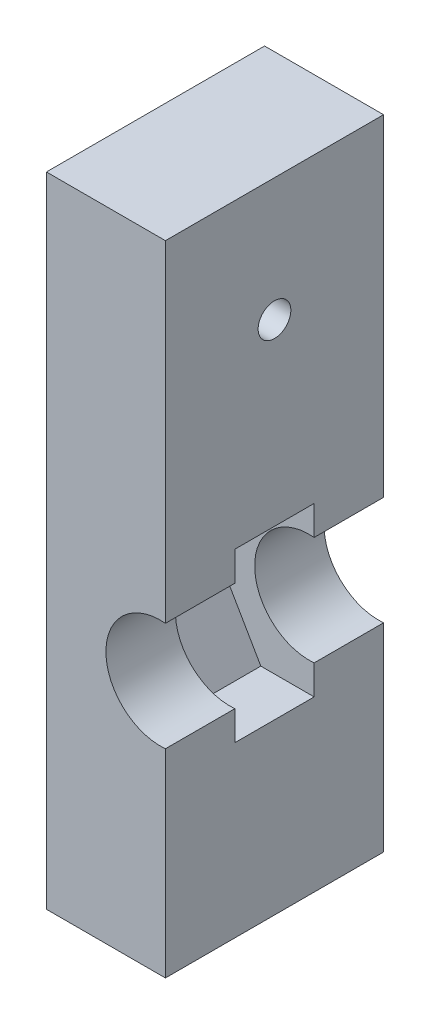
ISO-10303-21;
HEADER;
FILE_DESCRIPTION(('STEP AP214'),'2;1');
FILE_NAME('part.step','',(''),(''),'','','');
FILE_SCHEMA(('AUTOMOTIVE_DESIGN { 1 0 10303 214 1 1 1 1 }'));
ENDSEC;
DATA;
#1=APPLICATION_CONTEXT('core data for automotive mechanical design processes');
#2=APPLICATION_PROTOCOL_DEFINITION('international standard','automotive_design',2000,#1);
#3=PRODUCT_CONTEXT('',#1,'mechanical');
#4=PRODUCT('Part','Part','',(#3));
#5=PRODUCT_RELATED_PRODUCT_CATEGORY('part','',(#4));
#6=PRODUCT_DEFINITION_FORMATION('','',#4);
#7=PRODUCT_DEFINITION_CONTEXT('part definition',#1,'design');
#8=PRODUCT_DEFINITION('design','',#6,#7);
#9=PRODUCT_DEFINITION_SHAPE('','',#8);
#10=(LENGTH_UNIT() NAMED_UNIT(*) SI_UNIT(.MILLI.,.METRE.));
#11=(NAMED_UNIT(*) PLANE_ANGLE_UNIT() SI_UNIT($,.RADIAN.));
#12=(NAMED_UNIT(*) SI_UNIT($,.STERADIAN.) SOLID_ANGLE_UNIT());
#13=UNCERTAINTY_MEASURE_WITH_UNIT(LENGTH_MEASURE(1.E-05),#10,'distance_accuracy_value','');
#14=(GEOMETRIC_REPRESENTATION_CONTEXT(3) GLOBAL_UNCERTAINTY_ASSIGNED_CONTEXT((#13)) GLOBAL_UNIT_ASSIGNED_CONTEXT((#10,
#11,#12)) REPRESENTATION_CONTEXT('',''));
#15=CARTESIAN_POINT('',(0.,0.,0.));
#16=DIRECTION('',(0.,0.,1.));
#17=DIRECTION('',(1.,0.,0.));
#18=AXIS2_PLACEMENT_3D('',#15,#16,#17);
#19=CARTESIAN_POINT('',(-11.8674698795181,-59.7793146590531,8.));
#20=DIRECTION('',(0.,1.,0.));
#21=DIRECTION('',(0.,0.,1.));
#22=AXIS2_PLACEMENT_3D('',#19,#20,#21);
#23=PLANE('',#22);
#24=DIRECTION('',(0.,0.,-1.));
#25=VECTOR('',#24,1.);
#26=CARTESIAN_POINT('',(0.132530120481924,-59.7793146590531,15.));
#27=LINE('',#26,#25);
#28=CARTESIAN_POINT('',(0.132530120481924,-59.7793146590531,15.));
#29=VERTEX_POINT('',#28);
#30=CARTESIAN_POINT('',(0.132530120481924,-59.7793146590531,-7.));
#31=VERTEX_POINT('',#30);
#32=EDGE_CURVE('E133',#29,#31,#27,.T.);
#33=ORIENTED_EDGE('',*,*,#32,.F.);
#34=DIRECTION('',(1.,0.,0.));
#35=VECTOR('',#34,1.);
#36=CARTESIAN_POINT('',(-11.8674698795181,-59.7793146590531,15.));
#37=LINE('',#36,#35);
#38=CARTESIAN_POINT('',(-11.8674698795181,-59.7793146590531,15.));
#39=VERTEX_POINT('',#38);
#40=EDGE_CURVE('E145',#39,#29,#37,.T.);
#41=ORIENTED_EDGE('',*,*,#40,.F.);
#42=DIRECTION('',(0.,0.,-1.));
#43=VECTOR('',#42,1.);
#44=CARTESIAN_POINT('',(-11.8674698795181,-59.7793146590531,8.));
#45=LINE('',#44,#43);
#46=CARTESIAN_POINT('',(-11.8674698795181,-59.7793146590531,-7.));
#47=VERTEX_POINT('',#46);
#48=EDGE_CURVE('E11',#39,#47,#45,.T.);
#49=ORIENTED_EDGE('',*,*,#48,.T.);
#50=DIRECTION('',(-1.,0.,0.));
#51=VECTOR('',#50,1.);
#52=CARTESIAN_POINT('',(11.1325301204819,-59.7793146590531,-7.));
#53=LINE('',#52,#51);
#54=EDGE_CURVE('E147',#31,#47,#53,.T.);
#55=ORIENTED_EDGE('',*,*,#54,.F.);
#56=EDGE_LOOP('',(#33,#41,#49,#55));
#57=FACE_BOUND('',#56,.T.);
#58=ADVANCED_FACE('F36',(#57),#23,.F.);
#59=CARTESIAN_POINT('',(-11.8674698795181,4.62068534094692,8.));
#60=DIRECTION('',(0.,-1.,0.));
#61=DIRECTION('',(1.,0.,0.));
#62=AXIS2_PLACEMENT_3D('',#59,#60,#61);
#63=PLANE('',#62);
#64=DIRECTION('',(0.,0.,1.));
#65=VECTOR('',#64,1.);
#66=CARTESIAN_POINT('',(0.132530120481913,4.62068534094692,15.));
#67=LINE('',#66,#65);
#68=CARTESIAN_POINT('',(0.132530120481913,4.62068534094692,-7.));
#69=VERTEX_POINT('',#68);
#70=CARTESIAN_POINT('',(0.132530120481913,4.62068534094692,15.));
#71=VERTEX_POINT('',#70);
#72=EDGE_CURVE('E205',#69,#71,#67,.T.);
#73=ORIENTED_EDGE('',*,*,#72,.F.);
#74=DIRECTION('',(1.,0.,0.));
#75=VECTOR('',#74,1.);
#76=CARTESIAN_POINT('',(11.1325301204819,4.62068534094692,-7.));
#77=LINE('',#76,#75);
#78=CARTESIAN_POINT('',(-11.8674698795181,4.62068534094692,-7.));
#79=VERTEX_POINT('',#78);
#80=EDGE_CURVE('E201',#79,#69,#77,.T.);
#81=ORIENTED_EDGE('',*,*,#80,.F.);
#82=DIRECTION('',(0.,0.,-1.));
#83=VECTOR('',#82,1.);
#84=CARTESIAN_POINT('',(-11.8674698795181,4.62068534094692,8.));
#85=LINE('',#84,#83);
#86=CARTESIAN_POINT('',(-11.8674698795181,4.62068534094692,15.));
#87=VERTEX_POINT('',#86);
#88=EDGE_CURVE('E45',#87,#79,#85,.T.);
#89=ORIENTED_EDGE('',*,*,#88,.F.);
#90=DIRECTION('',(-1.,0.,0.));
#91=VECTOR('',#90,1.);
#92=CARTESIAN_POINT('',(-11.8674698795181,4.62068534094692,15.));
#93=LINE('',#92,#91);
#94=EDGE_CURVE('E153',#71,#87,#93,.T.);
#95=ORIENTED_EDGE('',*,*,#94,.F.);
#96=EDGE_LOOP('',(#73,#81,#89,#95));
#97=FACE_BOUND('',#96,.T.);
#98=ADVANCED_FACE('F204',(#97),#63,.F.);
#99=CARTESIAN_POINT('',(4.51113989513426,-25.8293146590531,8.));
#100=DIRECTION('',(0.,-1.,0.));
#101=DIRECTION('',(0.,0.,-1.));
#102=AXIS2_PLACEMENT_3D('',#99,#100,#101);
#103=PLANE('',#102);
#104=DIRECTION('',(-1.,0.,0.));
#105=VECTOR('',#104,1.);
#106=CARTESIAN_POINT('',(4.51113989513426,-25.8293146590531,0.));
#107=LINE('',#106,#105);
#108=CARTESIAN_POINT('',(0.132530120481917,-25.8293146590531,0.));
#109=VERTEX_POINT('',#108);
#110=CARTESIAN_POINT('',(-5.24607965417042,-25.8293146590531,0.));
#111=VERTEX_POINT('',#110);
#112=EDGE_CURVE('E155',#109,#111,#107,.T.);
#113=ORIENTED_EDGE('',*,*,#112,.F.);
#114=DIRECTION('',(0.,0.,1.));
#115=VECTOR('',#114,1.);
#116=CARTESIAN_POINT('',(0.132530120481917,-25.8293146590531,8.));
#117=LINE('',#116,#115);
#118=CARTESIAN_POINT('',(0.132530120481917,-25.8293146590531,8.));
#119=VERTEX_POINT('',#118);
#120=EDGE_CURVE('E233',#109,#119,#117,.T.);
#121=ORIENTED_EDGE('',*,*,#120,.T.);
#122=DIRECTION('',(-1.,0.,0.));
#123=VECTOR('',#122,1.);
#124=CARTESIAN_POINT('',(4.51113989513426,-25.8293146590531,8.));
#125=LINE('',#124,#123);
#126=CARTESIAN_POINT('',(-5.24607965417042,-25.8293146590531,8.));
#127=VERTEX_POINT('',#126);
#128=EDGE_CURVE('E161',#119,#127,#125,.T.);
#129=ORIENTED_EDGE('',*,*,#128,.T.);
#130=DIRECTION('',(0.,0.,-1.));
#131=VECTOR('',#130,1.);
#132=CARTESIAN_POINT('',(-5.24607965417042,-25.8293146590531,8.));
#133=LINE('',#132,#131);
#134=EDGE_CURVE('E186',#127,#111,#133,.T.);
#135=ORIENTED_EDGE('',*,*,#134,.T.);
#136=EDGE_LOOP('',(#113,#121,#129,#135));
#137=FACE_BOUND('',#136,.T.);
#138=ADVANCED_FACE('F272',(#137),#103,.T.);
#139=CARTESIAN_POINT('',(-5.24607965417041,-42.7293146590531,8.));
#140=DIRECTION('',(0.,1.,0.));
#141=DIRECTION('',(0.,0.,1.));
#142=AXIS2_PLACEMENT_3D('',#139,#140,#141);
#143=PLANE('',#142);
#144=DIRECTION('',(1.,0.,0.));
#145=VECTOR('',#144,1.);
#146=CARTESIAN_POINT('',(-5.24607965417041,-42.7293146590531,8.));
#147=LINE('',#146,#145);
#148=CARTESIAN_POINT('',(-5.24607965417041,-42.7293146590531,8.));
#149=VERTEX_POINT('',#148);
#150=CARTESIAN_POINT('',(0.13253012048192,-42.7293146590531,8.));
#151=VERTEX_POINT('',#150);
#152=EDGE_CURVE('E170',#149,#151,#147,.T.);
#153=ORIENTED_EDGE('',*,*,#152,.T.);
#154=DIRECTION('',(0.,0.,-1.));
#155=VECTOR('',#154,1.);
#156=CARTESIAN_POINT('',(0.13253012048192,-42.7293146590531,8.));
#157=LINE('',#156,#155);
#158=CARTESIAN_POINT('',(0.13253012048192,-42.7293146590531,0.));
#159=VERTEX_POINT('',#158);
#160=EDGE_CURVE('E224',#151,#159,#157,.T.);
#161=ORIENTED_EDGE('',*,*,#160,.T.);
#162=DIRECTION('',(1.,0.,0.));
#163=VECTOR('',#162,1.);
#164=CARTESIAN_POINT('',(-5.24607965417041,-42.7293146590531,0.));
#165=LINE('',#164,#163);
#166=CARTESIAN_POINT('',(-5.24607965417041,-42.7293146590531,0.));
#167=VERTEX_POINT('',#166);
#168=EDGE_CURVE('E164',#167,#159,#165,.T.);
#169=ORIENTED_EDGE('',*,*,#168,.F.);
#170=DIRECTION('',(0.,0.,-1.));
#171=VECTOR('',#170,1.);
#172=CARTESIAN_POINT('',(-5.24607965417041,-42.7293146590531,8.));
#173=LINE('',#172,#171);
#174=EDGE_CURVE('E173',#149,#167,#173,.T.);
#175=ORIENTED_EDGE('',*,*,#174,.F.);
#176=EDGE_LOOP('',(#153,#161,#169,#175));
#177=FACE_BOUND('',#176,.T.);
#178=ADVANCED_FACE('F277',(#177),#143,.T.);
#179=CARTESIAN_POINT('',(0.,0.,15.));
#180=DIRECTION('',(0.,0.,1.));
#181=DIRECTION('',(1.,0.,0.));
#182=AXIS2_PLACEMENT_3D('',#179,#180,#181);
#183=PLANE('',#182);
#184=ORIENTED_EDGE('',*,*,#40,.T.);
#185=DIRECTION('',(0.,-1.,0.));
#186=VECTOR('',#185,1.);
#187=CARTESIAN_POINT('',(0.132530120481913,4.62068534094692,15.));
#188=LINE('',#187,#186);
#189=CARTESIAN_POINT('',(0.13253012048192,-39.7565402341047,15.));
#190=VERTEX_POINT('',#189);
#191=EDGE_CURVE('E130',#190,#29,#188,.T.);
#192=ORIENTED_EDGE('',*,*,#191,.F.);
#193=CARTESIAN_POINT('',(-0.367469879518079,-34.2793146590531,15.));
#194=DIRECTION('',(0.,0.,1.));
#195=DIRECTION('',(1.,0.,0.));
#196=AXIS2_PLACEMENT_3D('',#193,#194,#195);
#197=CIRCLE('',#196,5.5);
#198=CARTESIAN_POINT('',(0.132530120481919,-28.8020890840014,15.));
#199=VERTEX_POINT('',#198);
#200=EDGE_CURVE('E157',#199,#190,#197,.T.);
#201=ORIENTED_EDGE('',*,*,#200,.F.);
#202=EDGE_CURVE('E140',#71,#199,#188,.T.);
#203=ORIENTED_EDGE('',*,*,#202,.F.);
#204=ORIENTED_EDGE('',*,*,#94,.T.);
#205=DIRECTION('',(0.,-1.,0.));
#206=VECTOR('',#205,1.);
#207=CARTESIAN_POINT('',(-11.8674698795181,4.62068534094692,15.));
#208=LINE('',#207,#206);
#209=EDGE_CURVE('E152',#87,#39,#208,.T.);
#210=ORIENTED_EDGE('',*,*,#209,.T.);
#211=EDGE_LOOP('',(#184,#192,#201,#203,#204,#210));
#212=FACE_BOUND('',#211,.T.);
#213=ADVANCED_FACE('F150',(#212),#183,.T.);
#214=CARTESIAN_POINT('',(0.,0.,8.));
#215=DIRECTION('',(0.,0.,1.));
#216=DIRECTION('',(1.,0.,0.));
#217=AXIS2_PLACEMENT_3D('',#214,#215,#216);
#218=PLANE('',#217);
#219=DIRECTION('',(0.,1.,0.));
#220=VECTOR('',#219,1.);
#221=CARTESIAN_POINT('',(0.132530120481913,0.,8.));
#222=LINE('',#221,#220);
#223=CARTESIAN_POINT('',(0.13253012048192,-39.7565402341047,8.));
#224=VERTEX_POINT('',#223);
#225=EDGE_CURVE('E227',#151,#224,#222,.T.);
#226=ORIENTED_EDGE('',*,*,#225,.F.);
#227=ORIENTED_EDGE('',*,*,#152,.F.);
#228=DIRECTION('',(0.5,-0.866025403784438,0.));
#229=VECTOR('',#228,1.);
#230=CARTESIAN_POINT('',(-10.1246894288228,-34.2793146590531,8.));
#231=LINE('',#230,#229);
#232=CARTESIAN_POINT('',(-10.1246894288228,-34.2793146590531,8.));
#233=VERTEX_POINT('',#232);
#234=EDGE_CURVE('E167',#233,#149,#231,.T.);
#235=ORIENTED_EDGE('',*,*,#234,.F.);
#236=DIRECTION('',(-0.5,-0.866025403784439,0.));
#237=VECTOR('',#236,1.);
#238=CARTESIAN_POINT('',(-5.24607965417042,-25.8293146590531,8.));
#239=LINE('',#238,#237);
#240=EDGE_CURVE('E163',#127,#233,#239,.T.);
#241=ORIENTED_EDGE('',*,*,#240,.F.);
#242=ORIENTED_EDGE('',*,*,#128,.F.);
#243=CARTESIAN_POINT('',(0.132530120481918,-28.8020890840014,8.));
#244=VERTEX_POINT('',#243);
#245=EDGE_CURVE('E229',#244,#119,#222,.T.);
#246=ORIENTED_EDGE('',*,*,#245,.F.);
#247=CARTESIAN_POINT('',(-0.367469879518079,-34.2793146590531,8.));
#248=DIRECTION('',(0.,0.,1.));
#249=DIRECTION('',(1.,0.,0.));
#250=AXIS2_PLACEMENT_3D('',#247,#248,#249);
#251=CIRCLE('',#250,5.5);
#252=EDGE_CURVE('E206',#244,#224,#251,.T.);
#253=ORIENTED_EDGE('',*,*,#252,.T.);
#254=EDGE_LOOP('',(#226,#227,#235,#241,#242,#246,#253));
#255=FACE_BOUND('',#254,.T.);
#256=ADVANCED_FACE('F285',(#255),#218,.F.);
#257=CARTESIAN_POINT('',(-0.367469879518079,-34.2793146590531,15.));
#258=DIRECTION('',(0.,0.,-1.));
#259=DIRECTION('',(-1.,0.,0.));
#260=AXIS2_PLACEMENT_3D('',#257,#258,#259);
#261=CYLINDRICAL_SURFACE('',#260,5.5);
#262=ORIENTED_EDGE('',*,*,#200,.T.);
#263=DIRECTION('',(0.,0.,-1.));
#264=VECTOR('',#263,1.);
#265=CARTESIAN_POINT('',(0.13253012048192,-39.7565402341047,15.));
#266=LINE('',#265,#264);
#267=EDGE_CURVE('E135',#190,#224,#266,.T.);
#268=ORIENTED_EDGE('',*,*,#267,.T.);
#269=ORIENTED_EDGE('',*,*,#252,.F.);
#270=DIRECTION('',(0.,0.,-1.));
#271=VECTOR('',#270,1.);
#272=CARTESIAN_POINT('',(0.132530120481918,-28.8020890840014,15.));
#273=LINE('',#272,#271);
#274=EDGE_CURVE('E215',#244,#199,#273,.F.);
#275=ORIENTED_EDGE('',*,*,#274,.T.);
#276=EDGE_LOOP('',(#262,#268,#269,#275));
#277=FACE_BOUND('',#276,.T.);
#278=ADVANCED_FACE('F213',(#277),#261,.F.);
#279=CARTESIAN_POINT('',(0.,0.,0.));
#280=DIRECTION('',(0.,0.,-1.));
#281=DIRECTION('',(-1.,0.,0.));
#282=AXIS2_PLACEMENT_3D('',#279,#280,#281);
#283=PLANE('',#282);
#284=DIRECTION('',(0.,-1.,0.));
#285=VECTOR('',#284,1.);
#286=CARTESIAN_POINT('',(0.132530120481913,0.,0.));
#287=LINE('',#286,#285);
#288=CARTESIAN_POINT('',(0.132530120481918,-28.8020890840014,0.));
#289=VERTEX_POINT('',#288);
#290=EDGE_CURVE('E52',#109,#289,#287,.T.);
#291=ORIENTED_EDGE('',*,*,#290,.F.);
#292=ORIENTED_EDGE('',*,*,#112,.T.);
#293=DIRECTION('',(-0.5,-0.866025403784439,0.));
#294=VECTOR('',#293,1.);
#295=CARTESIAN_POINT('',(-5.24607965417042,-25.8293146590531,0.));
#296=LINE('',#295,#294);
#297=CARTESIAN_POINT('',(-10.1246894288228,-34.2793146590531,0.));
#298=VERTEX_POINT('',#297);
#299=EDGE_CURVE('E175',#111,#298,#296,.T.);
#300=ORIENTED_EDGE('',*,*,#299,.T.);
#301=DIRECTION('',(0.5,-0.866025403784438,0.));
#302=VECTOR('',#301,1.);
#303=CARTESIAN_POINT('',(-10.1246894288228,-34.2793146590531,0.));
#304=LINE('',#303,#302);
#305=EDGE_CURVE('E178',#298,#167,#304,.T.);
#306=ORIENTED_EDGE('',*,*,#305,.T.);
#307=ORIENTED_EDGE('',*,*,#168,.T.);
#308=CARTESIAN_POINT('',(0.13253012048192,-39.7565402341047,0.));
#309=VERTEX_POINT('',#308);
#310=EDGE_CURVE('E222',#309,#159,#287,.T.);
#311=ORIENTED_EDGE('',*,*,#310,.F.);
#312=CARTESIAN_POINT('',(-0.367469879518079,-34.2793146590531,0.));
#313=DIRECTION('',(0.,0.,-1.));
#314=DIRECTION('',(-1.,0.,0.));
#315=AXIS2_PLACEMENT_3D('',#312,#313,#314);
#316=CIRCLE('',#315,5.5);
#317=EDGE_CURVE('E240',#309,#289,#316,.T.);
#318=ORIENTED_EDGE('',*,*,#317,.T.);
#319=EDGE_LOOP('',(#291,#292,#300,#306,#307,#311,#318));
#320=FACE_BOUND('',#319,.T.);
#321=ADVANCED_FACE('F248',(#320),#283,.F.);
#322=CARTESIAN_POINT('',(0.,0.,-7.));
#323=DIRECTION('',(0.,0.,-1.));
#324=DIRECTION('',(-1.,0.,0.));
#325=AXIS2_PLACEMENT_3D('',#322,#323,#324);
#326=PLANE('',#325);
#327=ORIENTED_EDGE('',*,*,#80,.T.);
#328=DIRECTION('',(0.,1.,0.));
#329=VECTOR('',#328,1.);
#330=CARTESIAN_POINT('',(0.132530120481913,4.62068534094692,-7.));
#331=LINE('',#330,#329);
#332=CARTESIAN_POINT('',(0.132530120481919,-28.8020890840014,-7.));
#333=VERTEX_POINT('',#332);
#334=EDGE_CURVE('E148',#333,#69,#331,.T.);
#335=ORIENTED_EDGE('',*,*,#334,.F.);
#336=CARTESIAN_POINT('',(-0.367469879518079,-34.2793146590531,-7.));
#337=DIRECTION('',(0.,0.,-1.));
#338=DIRECTION('',(-1.,0.,0.));
#339=AXIS2_PLACEMENT_3D('',#336,#337,#338);
#340=CIRCLE('',#339,5.5);
#341=CARTESIAN_POINT('',(0.13253012048192,-39.7565402341047,-7.));
#342=VERTEX_POINT('',#341);
#343=EDGE_CURVE('E241',#342,#333,#340,.T.);
#344=ORIENTED_EDGE('',*,*,#343,.F.);
#345=EDGE_CURVE('E60',#31,#342,#331,.T.);
#346=ORIENTED_EDGE('',*,*,#345,.F.);
#347=ORIENTED_EDGE('',*,*,#54,.T.);
#348=DIRECTION('',(0.,1.,0.));
#349=VECTOR('',#348,1.);
#350=CARTESIAN_POINT('',(-11.8674698795181,4.62068534094692,-7.));
#351=LINE('',#350,#349);
#352=EDGE_CURVE('E193',#47,#79,#351,.T.);
#353=ORIENTED_EDGE('',*,*,#352,.T.);
#354=EDGE_LOOP('',(#327,#335,#344,#346,#347,#353));
#355=FACE_BOUND('',#354,.T.);
#356=ADVANCED_FACE('F199',(#355),#326,.T.);
#357=CARTESIAN_POINT('',(-0.367469879518079,-34.2793146590531,-7.));
#358=DIRECTION('',(0.,0.,1.));
#359=DIRECTION('',(1.,0.,0.));
#360=AXIS2_PLACEMENT_3D('',#357,#358,#359);
#361=CYLINDRICAL_SURFACE('',#360,5.5);
#362=ORIENTED_EDGE('',*,*,#343,.T.);
#363=DIRECTION('',(0.,0.,1.));
#364=VECTOR('',#363,1.);
#365=CARTESIAN_POINT('',(0.132530120481918,-28.8020890840014,-7.));
#366=LINE('',#365,#364);
#367=EDGE_CURVE('E231',#333,#289,#366,.T.);
#368=ORIENTED_EDGE('',*,*,#367,.T.);
#369=ORIENTED_EDGE('',*,*,#317,.F.);
#370=DIRECTION('',(0.,0.,1.));
#371=VECTOR('',#370,1.);
#372=CARTESIAN_POINT('',(0.13253012048192,-39.7565402341047,-7.));
#373=LINE('',#372,#371);
#374=EDGE_CURVE('E220',#309,#342,#373,.F.);
#375=ORIENTED_EDGE('',*,*,#374,.T.);
#376=EDGE_LOOP('',(#362,#368,#369,#375));
#377=FACE_BOUND('',#376,.T.);
#378=ADVANCED_FACE('F251',(#377),#361,.F.);
#379=CARTESIAN_POINT('',(-11.8674698795181,-7.77931465905308,4.));
#380=DIRECTION('',(1.,0.,0.));
#381=DIRECTION('',(0.,1.,0.));
#382=AXIS2_PLACEMENT_3D('',#379,#380,#381);
#383=CYLINDRICAL_SURFACE('',#382,1.65);
#384=CARTESIAN_POINT('',(-11.8674698795181,-7.77931465905308,4.));
#385=DIRECTION('',(1.,0.,0.));
#386=DIRECTION('',(0.,1.,0.));
#387=AXIS2_PLACEMENT_3D('',#384,#385,#386);
#388=CIRCLE('',#387,1.65);
#389=CARTESIAN_POINT('',(-11.8674698795181,-6.12931465905308,4.));
#390=VERTEX_POINT('',#389);
#391=EDGE_CURVE('E237',#390,#390,#388,.T.);
#392=ORIENTED_EDGE('',*,*,#391,.F.);
#393=EDGE_LOOP('',(#392));
#394=FACE_BOUND('',#393,.T.);
#395=CARTESIAN_POINT('',(0.132530120481915,-7.77931465905308,4.));
#396=DIRECTION('',(1.,0.,0.));
#397=DIRECTION('',(0.,1.,0.));
#398=AXIS2_PLACEMENT_3D('',#395,#396,#397);
#399=CIRCLE('',#398,1.65);
#400=CARTESIAN_POINT('',(0.132530120481915,-6.12931465905308,4.));
#401=VERTEX_POINT('',#400);
#402=EDGE_CURVE('E40',#401,#401,#399,.F.);
#403=ORIENTED_EDGE('',*,*,#402,.F.);
#404=EDGE_LOOP('',(#403));
#405=FACE_BOUND('',#404,.T.);
#406=ADVANCED_FACE('F298',(#394,#405),#383,.F.);
#407=CARTESIAN_POINT('',(-11.8674698795181,4.62068534094692,8.));
#408=DIRECTION('',(1.,0.,0.));
#409=DIRECTION('',(0.,1.,0.));
#410=AXIS2_PLACEMENT_3D('',#407,#408,#409);
#411=PLANE('',#410);
#412=ORIENTED_EDGE('',*,*,#391,.T.);
#413=EDGE_LOOP('',(#412));
#414=FACE_BOUND('',#413,.T.);
#415=ORIENTED_EDGE('',*,*,#88,.T.);
#416=ORIENTED_EDGE('',*,*,#352,.F.);
#417=ORIENTED_EDGE('',*,*,#48,.F.);
#418=ORIENTED_EDGE('',*,*,#209,.F.);
#419=EDGE_LOOP('',(#415,#416,#417,#418));
#420=FACE_BOUND('',#419,.T.);
#421=ADVANCED_FACE('F38',(#414,#420),#411,.F.);
#422=CARTESIAN_POINT('',(-5.24607965417042,-25.8293146590531,8.));
#423=DIRECTION('',(0.866025403784439,-0.5,0.));
#424=DIRECTION('',(0.5,0.866025403784439,0.));
#425=AXIS2_PLACEMENT_3D('',#422,#423,#424);
#426=PLANE('',#425);
#427=ORIENTED_EDGE('',*,*,#299,.F.);
#428=ORIENTED_EDGE('',*,*,#134,.F.);
#429=ORIENTED_EDGE('',*,*,#240,.T.);
#430=DIRECTION('',(0.,0.,-1.));
#431=VECTOR('',#430,1.);
#432=CARTESIAN_POINT('',(-10.1246894288228,-34.2793146590531,8.));
#433=LINE('',#432,#431);
#434=EDGE_CURVE('E184',#233,#298,#433,.T.);
#435=ORIENTED_EDGE('',*,*,#434,.T.);
#436=EDGE_LOOP('',(#427,#428,#429,#435));
#437=FACE_BOUND('',#436,.T.);
#438=ADVANCED_FACE('F263',(#437),#426,.T.);
#439=CARTESIAN_POINT('',(-10.1246894288228,-34.2793146590531,8.));
#440=DIRECTION('',(0.866025403784439,0.5,0.));
#441=DIRECTION('',(-0.5,0.866025403784439,0.));
#442=AXIS2_PLACEMENT_3D('',#439,#440,#441);
#443=PLANE('',#442);
#444=ORIENTED_EDGE('',*,*,#305,.F.);
#445=ORIENTED_EDGE('',*,*,#434,.F.);
#446=ORIENTED_EDGE('',*,*,#234,.T.);
#447=ORIENTED_EDGE('',*,*,#174,.T.);
#448=EDGE_LOOP('',(#444,#445,#446,#447));
#449=FACE_BOUND('',#448,.T.);
#450=ADVANCED_FACE('F256',(#449),#443,.T.);
#451=CARTESIAN_POINT('',(0.132530120481913,0.,0.));
#452=DIRECTION('',(1.,0.,0.));
#453=DIRECTION('',(0.,1.,0.));
#454=AXIS2_PLACEMENT_3D('',#451,#452,#453);
#455=PLANE('',#454);
#456=ORIENTED_EDGE('',*,*,#402,.T.);
#457=EDGE_LOOP('',(#456));
#458=FACE_BOUND('',#457,.T.);
#459=ORIENTED_EDGE('',*,*,#245,.T.);
#460=ORIENTED_EDGE('',*,*,#120,.F.);
#461=ORIENTED_EDGE('',*,*,#290,.T.);
#462=ORIENTED_EDGE('',*,*,#367,.F.);
#463=ORIENTED_EDGE('',*,*,#334,.T.);
#464=ORIENTED_EDGE('',*,*,#72,.T.);
#465=ORIENTED_EDGE('',*,*,#202,.T.);
#466=ORIENTED_EDGE('',*,*,#274,.F.);
#467=EDGE_LOOP('',(#459,#460,#461,#462,#463,#464,#465,#466));
#468=FACE_BOUND('',#467,.T.);
#469=ADVANCED_FACE('F253',(#458,#468),#455,.T.);
#470=ORIENTED_EDGE('',*,*,#191,.T.);
#471=ORIENTED_EDGE('',*,*,#32,.T.);
#472=ORIENTED_EDGE('',*,*,#345,.T.);
#473=ORIENTED_EDGE('',*,*,#374,.F.);
#474=ORIENTED_EDGE('',*,*,#310,.T.);
#475=ORIENTED_EDGE('',*,*,#160,.F.);
#476=ORIENTED_EDGE('',*,*,#225,.T.);
#477=ORIENTED_EDGE('',*,*,#267,.F.);
#478=EDGE_LOOP('',(#470,#471,#472,#473,#474,#475,#476,#477));
#479=FACE_BOUND('',#478,.T.);
#480=ADVANCED_FACE('F132',(#479),#455,.T.);
#481=CLOSED_SHELL('',(#58,#98,#138,#178,#213,#256,#278,#321,#356,#378,#406,#421,#438,#450,#469,#480));
#482=MANIFOLD_SOLID_BREP('B2',#481);
#483=ADVANCED_BREP_SHAPE_REPRESENTATION('',(#18,#482),#14);
#484=SHAPE_DEFINITION_REPRESENTATION(#9,#483);
ENDSEC;
END-ISO-10303-21;
